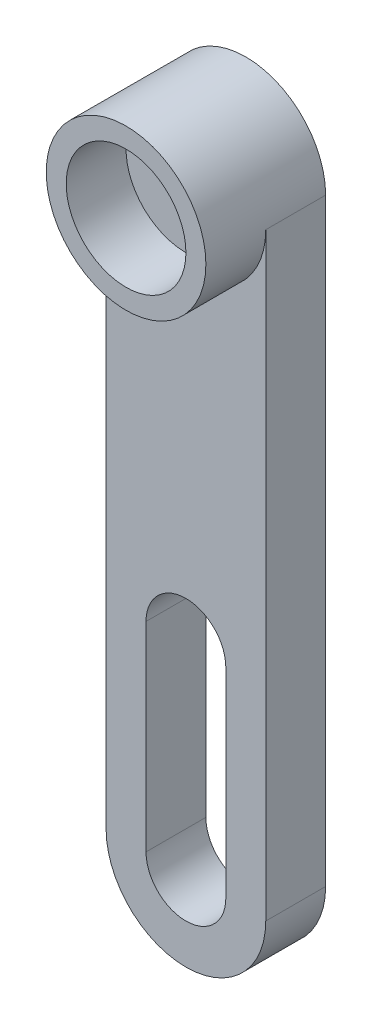
ISO-10303-21;
HEADER;
FILE_DESCRIPTION(('STEP AP214'),'2;1');
FILE_NAME('part.step','',(''),(''),'','','');
FILE_SCHEMA(('AUTOMOTIVE_DESIGN { 1 0 10303 214 1 1 1 1 }'));
ENDSEC;
DATA;
#1=APPLICATION_CONTEXT('core data for automotive mechanical design processes');
#2=APPLICATION_PROTOCOL_DEFINITION('international standard','automotive_design',2000,#1);
#3=PRODUCT_CONTEXT('',#1,'mechanical');
#4=PRODUCT('Part','Part','',(#3));
#5=PRODUCT_RELATED_PRODUCT_CATEGORY('part','',(#4));
#6=PRODUCT_DEFINITION_FORMATION('','',#4);
#7=PRODUCT_DEFINITION_CONTEXT('part definition',#1,'design');
#8=PRODUCT_DEFINITION('design','',#6,#7);
#9=PRODUCT_DEFINITION_SHAPE('','',#8);
#10=(LENGTH_UNIT() NAMED_UNIT(*) SI_UNIT(.MILLI.,.METRE.));
#11=(NAMED_UNIT(*) PLANE_ANGLE_UNIT() SI_UNIT($,.RADIAN.));
#12=(NAMED_UNIT(*) SI_UNIT($,.STERADIAN.) SOLID_ANGLE_UNIT());
#13=UNCERTAINTY_MEASURE_WITH_UNIT(LENGTH_MEASURE(1.E-05),#10,'distance_accuracy_value','');
#14=(GEOMETRIC_REPRESENTATION_CONTEXT(3) GLOBAL_UNCERTAINTY_ASSIGNED_CONTEXT((#13)) GLOBAL_UNIT_ASSIGNED_CONTEXT((#10,
#11,#12)) REPRESENTATION_CONTEXT('',''));
#15=CARTESIAN_POINT('',(0.,0.,0.));
#16=DIRECTION('',(0.,0.,1.));
#17=DIRECTION('',(1.,0.,0.));
#18=AXIS2_PLACEMENT_3D('',#15,#16,#17);
#19=CARTESIAN_POINT('',(0.,15.,3.));
#20=DIRECTION('',(0.,0.,1.));
#21=DIRECTION('',(1.,0.,0.));
#22=AXIS2_PLACEMENT_3D('',#19,#20,#21);
#23=PLANE('',#22);
#24=CARTESIAN_POINT('',(0.,15.,3.));
#25=DIRECTION('',(0.,0.,1.));
#26=DIRECTION('',(1.,0.,0.));
#27=AXIS2_PLACEMENT_3D('',#24,#25,#26);
#28=CIRCLE('',#27,1.25);
#29=CARTESIAN_POINT('',(1.25,15.,3.));
#30=VERTEX_POINT('',#29);
#31=EDGE_CURVE('E159',#30,#30,#28,.T.);
#32=ORIENTED_EDGE('',*,*,#31,.F.);
#33=EDGE_LOOP('',(#32));
#34=FACE_BOUND('',#33,.T.);
#35=CARTESIAN_POINT('',(0.,15.,3.));
#36=DIRECTION('',(0.,0.,1.));
#37=DIRECTION('',(1.,0.,0.));
#38=AXIS2_PLACEMENT_3D('',#35,#36,#37);
#39=CIRCLE('',#38,3.);
#40=CARTESIAN_POINT('',(3.,15.,3.));
#41=VERTEX_POINT('',#40);
#42=EDGE_CURVE('E214',#41,#41,#39,.T.);
#43=ORIENTED_EDGE('',*,*,#42,.T.);
#44=EDGE_LOOP('',(#43));
#45=FACE_BOUND('',#44,.T.);
#46=ADVANCED_FACE('F43',(#34,#45),#23,.T.);
#47=CARTESIAN_POINT('',(0.,15.,3.));
#48=DIRECTION('',(0.,0.,1.));
#49=DIRECTION('',(1.,0.,0.));
#50=AXIS2_PLACEMENT_3D('',#47,#48,#49);
#51=CIRCLE('',#50,4.);
#52=CARTESIAN_POINT('',(-4.00000000000001,15.,3.));
#53=VERTEX_POINT('',#52);
#54=CARTESIAN_POINT('',(3.99999999999999,15.,3.));
#55=VERTEX_POINT('',#54);
#56=EDGE_CURVE('E11',#53,#55,#51,.T.);
#57=ORIENTED_EDGE('',*,*,#56,.F.);
#58=DIRECTION('',(0.,-1.,0.));
#59=VECTOR('',#58,1.);
#60=CARTESIAN_POINT('',(-4.00000000000001,15.,3.));
#61=LINE('',#60,#59);
#62=CARTESIAN_POINT('',(-4.,-15.,3.));
#63=VERTEX_POINT('',#62);
#64=EDGE_CURVE('E151',#53,#63,#61,.T.);
#65=ORIENTED_EDGE('',*,*,#64,.T.);
#66=CARTESIAN_POINT('',(0.,-15.,3.));
#67=DIRECTION('',(0.,0.,1.));
#68=DIRECTION('',(1.,0.,0.));
#69=AXIS2_PLACEMENT_3D('',#66,#67,#68);
#70=CIRCLE('',#69,4.);
#71=CARTESIAN_POINT('',(4.00000000000001,-15.,3.));
#72=VERTEX_POINT('',#71);
#73=EDGE_CURVE('E130',#63,#72,#70,.T.);
#74=ORIENTED_EDGE('',*,*,#73,.T.);
#75=DIRECTION('',(0.,1.,0.));
#76=VECTOR('',#75,1.);
#77=CARTESIAN_POINT('',(4.,15.,3.));
#78=LINE('',#77,#76);
#79=EDGE_CURVE('E116',#72,#55,#78,.T.);
#80=ORIENTED_EDGE('',*,*,#79,.T.);
#81=EDGE_LOOP('',(#57,#65,#74,#80));
#82=FACE_BOUND('',#81,.T.);
#83=DIRECTION('',(0.,-1.,0.));
#84=VECTOR('',#83,1.);
#85=CARTESIAN_POINT('',(-2.,-5.,3.));
#86=LINE('',#85,#84);
#87=CARTESIAN_POINT('',(-2.,-5.,3.));
#88=VERTEX_POINT('',#87);
#89=CARTESIAN_POINT('',(-2.,-15.,3.));
#90=VERTEX_POINT('',#89);
#91=EDGE_CURVE('E205',#88,#90,#86,.T.);
#92=ORIENTED_EDGE('',*,*,#91,.F.);
#93=CARTESIAN_POINT('',(0.,-5.,3.));
#94=DIRECTION('',(0.,0.,1.));
#95=DIRECTION('',(1.,0.,0.));
#96=AXIS2_PLACEMENT_3D('',#93,#94,#95);
#97=CIRCLE('',#96,2.);
#98=CARTESIAN_POINT('',(2.,-5.,3.));
#99=VERTEX_POINT('',#98);
#100=EDGE_CURVE('E188',#99,#88,#97,.T.);
#101=ORIENTED_EDGE('',*,*,#100,.F.);
#102=DIRECTION('',(0.,1.,0.));
#103=VECTOR('',#102,1.);
#104=CARTESIAN_POINT('',(2.,-15.,3.));
#105=LINE('',#104,#103);
#106=CARTESIAN_POINT('',(2.,-15.,3.));
#107=VERTEX_POINT('',#106);
#108=EDGE_CURVE('E183',#107,#99,#105,.T.);
#109=ORIENTED_EDGE('',*,*,#108,.F.);
#110=CARTESIAN_POINT('',(0.,-15.,3.));
#111=DIRECTION('',(0.,0.,1.));
#112=DIRECTION('',(1.,0.,0.));
#113=AXIS2_PLACEMENT_3D('',#110,#111,#112);
#114=CIRCLE('',#113,2.);
#115=EDGE_CURVE('E202',#90,#107,#114,.T.);
#116=ORIENTED_EDGE('',*,*,#115,.F.);
#117=EDGE_LOOP('',(#92,#101,#109,#116));
#118=FACE_BOUND('',#117,.T.);
#119=ADVANCED_FACE('F126',(#82,#118),#23,.T.);
#120=CARTESIAN_POINT('',(0.,15.,0.));
#121=DIRECTION('',(0.,0.,1.));
#122=DIRECTION('',(1.,0.,0.));
#123=AXIS2_PLACEMENT_3D('',#120,#121,#122);
#124=PLANE('',#123);
#125=CARTESIAN_POINT('',(0.,15.,0.));
#126=DIRECTION('',(0.,0.,1.));
#127=DIRECTION('',(1.,0.,0.));
#128=AXIS2_PLACEMENT_3D('',#125,#126,#127);
#129=CIRCLE('',#128,1.25);
#130=CARTESIAN_POINT('',(1.25,15.,0.));
#131=VERTEX_POINT('',#130);
#132=EDGE_CURVE('E165',#131,#131,#129,.T.);
#133=ORIENTED_EDGE('',*,*,#132,.T.);
#134=EDGE_LOOP('',(#133));
#135=FACE_BOUND('',#134,.T.);
#136=CARTESIAN_POINT('',(0.,15.,0.));
#137=DIRECTION('',(0.,0.,1.));
#138=DIRECTION('',(1.,0.,0.));
#139=AXIS2_PLACEMENT_3D('',#136,#137,#138);
#140=CIRCLE('',#139,4.);
#141=CARTESIAN_POINT('',(4.,15.,0.));
#142=VERTEX_POINT('',#141);
#143=CARTESIAN_POINT('',(-4.00000000000001,15.,0.));
#144=VERTEX_POINT('',#143);
#145=EDGE_CURVE('E137',#142,#144,#140,.T.);
#146=ORIENTED_EDGE('',*,*,#145,.F.);
#147=DIRECTION('',(0.,1.,0.));
#148=VECTOR('',#147,1.);
#149=CARTESIAN_POINT('',(4.,15.,0.));
#150=LINE('',#149,#148);
#151=CARTESIAN_POINT('',(4.00000000000001,-15.,0.));
#152=VERTEX_POINT('',#151);
#153=EDGE_CURVE('E118',#152,#142,#150,.T.);
#154=ORIENTED_EDGE('',*,*,#153,.F.);
#155=CARTESIAN_POINT('',(0.,-15.,0.));
#156=DIRECTION('',(0.,0.,1.));
#157=DIRECTION('',(1.,0.,0.));
#158=AXIS2_PLACEMENT_3D('',#155,#156,#157);
#159=CIRCLE('',#158,4.);
#160=CARTESIAN_POINT('',(-4.,-15.,0.));
#161=VERTEX_POINT('',#160);
#162=EDGE_CURVE('E152',#161,#152,#159,.T.);
#163=ORIENTED_EDGE('',*,*,#162,.F.);
#164=DIRECTION('',(0.,-1.,0.));
#165=VECTOR('',#164,1.);
#166=CARTESIAN_POINT('',(-4.00000000000001,15.,0.));
#167=LINE('',#166,#165);
#168=EDGE_CURVE('E155',#144,#161,#167,.T.);
#169=ORIENTED_EDGE('',*,*,#168,.F.);
#170=EDGE_LOOP('',(#146,#154,#163,#169));
#171=FACE_BOUND('',#170,.T.);
#172=CARTESIAN_POINT('',(0.,-5.,0.));
#173=DIRECTION('',(0.,0.,1.));
#174=DIRECTION('',(1.,0.,0.));
#175=AXIS2_PLACEMENT_3D('',#172,#173,#174);
#176=CIRCLE('',#175,2.);
#177=CARTESIAN_POINT('',(2.,-5.,0.));
#178=VERTEX_POINT('',#177);
#179=CARTESIAN_POINT('',(-2.,-5.,0.));
#180=VERTEX_POINT('',#179);
#181=EDGE_CURVE('E68',#178,#180,#176,.T.);
#182=ORIENTED_EDGE('',*,*,#181,.T.);
#183=DIRECTION('',(0.,-1.,0.));
#184=VECTOR('',#183,1.);
#185=CARTESIAN_POINT('',(-2.,-5.,0.));
#186=LINE('',#185,#184);
#187=CARTESIAN_POINT('',(-2.,-15.,0.));
#188=VERTEX_POINT('',#187);
#189=EDGE_CURVE('E193',#180,#188,#186,.T.);
#190=ORIENTED_EDGE('',*,*,#189,.T.);
#191=CARTESIAN_POINT('',(0.,-15.,0.));
#192=DIRECTION('',(0.,0.,1.));
#193=DIRECTION('',(1.,0.,0.));
#194=AXIS2_PLACEMENT_3D('',#191,#192,#193);
#195=CIRCLE('',#194,2.);
#196=CARTESIAN_POINT('',(2.,-15.,0.));
#197=VERTEX_POINT('',#196);
#198=EDGE_CURVE('E189',#188,#197,#195,.T.);
#199=ORIENTED_EDGE('',*,*,#198,.T.);
#200=DIRECTION('',(0.,1.,0.));
#201=VECTOR('',#200,1.);
#202=CARTESIAN_POINT('',(2.,-15.,0.));
#203=LINE('',#202,#201);
#204=EDGE_CURVE('E184',#197,#178,#203,.T.);
#205=ORIENTED_EDGE('',*,*,#204,.T.);
#206=EDGE_LOOP('',(#182,#190,#199,#205));
#207=FACE_BOUND('',#206,.T.);
#208=ADVANCED_FACE('F243',(#135,#171,#207),#124,.F.);
#209=CARTESIAN_POINT('',(0.,15.,3.));
#210=DIRECTION('',(0.,0.,-1.));
#211=DIRECTION('',(-1.,0.,0.));
#212=AXIS2_PLACEMENT_3D('',#209,#210,#211);
#213=CYLINDRICAL_SURFACE('',#212,4.);
#214=ORIENTED_EDGE('',*,*,#145,.T.);
#215=DIRECTION('',(0.,0.,-1.));
#216=VECTOR('',#215,1.);
#217=CARTESIAN_POINT('',(-4.00000000000001,15.,3.));
#218=LINE('',#217,#216);
#219=EDGE_CURVE('E47',#53,#144,#218,.T.);
#220=ORIENTED_EDGE('',*,*,#219,.F.);
#221=ORIENTED_EDGE('',*,*,#56,.T.);
#222=DIRECTION('',(0.,0.,-1.));
#223=VECTOR('',#222,1.);
#224=CARTESIAN_POINT('',(4.,15.,3.));
#225=LINE('',#224,#223);
#226=EDGE_CURVE('E112',#55,#142,#225,.T.);
#227=ORIENTED_EDGE('',*,*,#226,.T.);
#228=EDGE_LOOP('',(#214,#220,#221,#227));
#229=FACE_BOUND('',#228,.T.);
#230=CARTESIAN_POINT('',(0.,15.,6.));
#231=DIRECTION('',(0.,0.,1.));
#232=DIRECTION('',(1.,0.,0.));
#233=AXIS2_PLACEMENT_3D('',#230,#231,#232);
#234=CIRCLE('',#233,4.);
#235=CARTESIAN_POINT('',(3.99999999999999,15.,6.));
#236=VERTEX_POINT('',#235);
#237=EDGE_CURVE('E199',#236,#236,#234,.T.);
#238=ORIENTED_EDGE('',*,*,#237,.F.);
#239=EDGE_LOOP('',(#238));
#240=FACE_BOUND('',#239,.T.);
#241=ADVANCED_FACE('F45',(#229,#240),#213,.T.);
#242=CARTESIAN_POINT('',(-4.00000000000001,15.,3.));
#243=DIRECTION('',(1.,0.,0.));
#244=DIRECTION('',(0.,1.,0.));
#245=AXIS2_PLACEMENT_3D('',#242,#243,#244);
#246=PLANE('',#245);
#247=ORIENTED_EDGE('',*,*,#168,.T.);
#248=DIRECTION('',(0.,0.,-1.));
#249=VECTOR('',#248,1.);
#250=CARTESIAN_POINT('',(-4.,-15.,3.));
#251=LINE('',#250,#249);
#252=EDGE_CURVE('E140',#63,#161,#251,.T.);
#253=ORIENTED_EDGE('',*,*,#252,.F.);
#254=ORIENTED_EDGE('',*,*,#64,.F.);
#255=ORIENTED_EDGE('',*,*,#219,.T.);
#256=EDGE_LOOP('',(#247,#253,#254,#255));
#257=FACE_BOUND('',#256,.T.);
#258=ADVANCED_FACE('F257',(#257),#246,.F.);
#259=CARTESIAN_POINT('',(0.,-15.,3.));
#260=DIRECTION('',(0.,0.,-1.));
#261=DIRECTION('',(-1.,0.,0.));
#262=AXIS2_PLACEMENT_3D('',#259,#260,#261);
#263=CYLINDRICAL_SURFACE('',#262,4.);
#264=ORIENTED_EDGE('',*,*,#162,.T.);
#265=DIRECTION('',(0.,0.,-1.));
#266=VECTOR('',#265,1.);
#267=CARTESIAN_POINT('',(4.00000000000001,-15.,3.));
#268=LINE('',#267,#266);
#269=EDGE_CURVE('E123',#72,#152,#268,.T.);
#270=ORIENTED_EDGE('',*,*,#269,.F.);
#271=ORIENTED_EDGE('',*,*,#73,.F.);
#272=ORIENTED_EDGE('',*,*,#252,.T.);
#273=EDGE_LOOP('',(#264,#270,#271,#272));
#274=FACE_BOUND('',#273,.T.);
#275=ADVANCED_FACE('F255',(#274),#263,.T.);
#276=CARTESIAN_POINT('',(4.,15.,3.));
#277=DIRECTION('',(-1.,0.,0.));
#278=DIRECTION('',(0.,-1.,0.));
#279=AXIS2_PLACEMENT_3D('',#276,#277,#278);
#280=PLANE('',#279);
#281=ORIENTED_EDGE('',*,*,#153,.T.);
#282=ORIENTED_EDGE('',*,*,#226,.F.);
#283=ORIENTED_EDGE('',*,*,#79,.F.);
#284=ORIENTED_EDGE('',*,*,#269,.T.);
#285=EDGE_LOOP('',(#281,#282,#283,#284));
#286=FACE_BOUND('',#285,.T.);
#287=ADVANCED_FACE('F114',(#286),#280,.F.);
#288=CARTESIAN_POINT('',(0.,15.,3.));
#289=DIRECTION('',(0.,0.,-1.));
#290=DIRECTION('',(-1.,0.,0.));
#291=AXIS2_PLACEMENT_3D('',#288,#289,#290);
#292=CYLINDRICAL_SURFACE('',#291,1.25);
#293=ORIENTED_EDGE('',*,*,#31,.T.);
#294=EDGE_LOOP('',(#293));
#295=FACE_BOUND('',#294,.T.);
#296=ORIENTED_EDGE('',*,*,#132,.F.);
#297=EDGE_LOOP('',(#296));
#298=FACE_BOUND('',#297,.T.);
#299=ADVANCED_FACE('F248',(#295,#298),#292,.F.);
#300=CARTESIAN_POINT('',(0.,-5.,3.));
#301=DIRECTION('',(0.,0.,-1.));
#302=DIRECTION('',(-1.,0.,0.));
#303=AXIS2_PLACEMENT_3D('',#300,#301,#302);
#304=CYLINDRICAL_SURFACE('',#303,2.);
#305=ORIENTED_EDGE('',*,*,#181,.F.);
#306=DIRECTION('',(0.,0.,-1.));
#307=VECTOR('',#306,1.);
#308=CARTESIAN_POINT('',(2.,-5.,3.));
#309=LINE('',#308,#307);
#310=EDGE_CURVE('E180',#99,#178,#309,.T.);
#311=ORIENTED_EDGE('',*,*,#310,.F.);
#312=ORIENTED_EDGE('',*,*,#100,.T.);
#313=DIRECTION('',(0.,0.,-1.));
#314=VECTOR('',#313,1.);
#315=CARTESIAN_POINT('',(-2.,-5.,3.));
#316=LINE('',#315,#314);
#317=EDGE_CURVE('E169',#88,#180,#316,.T.);
#318=ORIENTED_EDGE('',*,*,#317,.T.);
#319=EDGE_LOOP('',(#305,#311,#312,#318));
#320=FACE_BOUND('',#319,.T.);
#321=ADVANCED_FACE('F267',(#320),#304,.F.);
#322=CARTESIAN_POINT('',(-2.,-5.,3.));
#323=DIRECTION('',(1.,0.,0.));
#324=DIRECTION('',(0.,1.,0.));
#325=AXIS2_PLACEMENT_3D('',#322,#323,#324);
#326=PLANE('',#325);
#327=ORIENTED_EDGE('',*,*,#189,.F.);
#328=ORIENTED_EDGE('',*,*,#317,.F.);
#329=ORIENTED_EDGE('',*,*,#91,.T.);
#330=DIRECTION('',(0.,0.,-1.));
#331=VECTOR('',#330,1.);
#332=CARTESIAN_POINT('',(-2.,-15.,3.));
#333=LINE('',#332,#331);
#334=EDGE_CURVE('E175',#90,#188,#333,.T.);
#335=ORIENTED_EDGE('',*,*,#334,.T.);
#336=EDGE_LOOP('',(#327,#328,#329,#335));
#337=FACE_BOUND('',#336,.T.);
#338=ADVANCED_FACE('F273',(#337),#326,.T.);
#339=CARTESIAN_POINT('',(0.,-15.,3.));
#340=DIRECTION('',(0.,0.,-1.));
#341=DIRECTION('',(-1.,0.,0.));
#342=AXIS2_PLACEMENT_3D('',#339,#340,#341);
#343=CYLINDRICAL_SURFACE('',#342,2.);
#344=ORIENTED_EDGE('',*,*,#198,.F.);
#345=ORIENTED_EDGE('',*,*,#334,.F.);
#346=ORIENTED_EDGE('',*,*,#115,.T.);
#347=DIRECTION('',(0.,0.,-1.));
#348=VECTOR('',#347,1.);
#349=CARTESIAN_POINT('',(2.,-15.,3.));
#350=LINE('',#349,#348);
#351=EDGE_CURVE('E60',#107,#197,#350,.T.);
#352=ORIENTED_EDGE('',*,*,#351,.T.);
#353=EDGE_LOOP('',(#344,#345,#346,#352));
#354=FACE_BOUND('',#353,.T.);
#355=ADVANCED_FACE('F235',(#354),#343,.F.);
#356=CARTESIAN_POINT('',(2.,-15.,3.));
#357=DIRECTION('',(-1.,0.,0.));
#358=DIRECTION('',(0.,-1.,0.));
#359=AXIS2_PLACEMENT_3D('',#356,#357,#358);
#360=PLANE('',#359);
#361=ORIENTED_EDGE('',*,*,#204,.F.);
#362=ORIENTED_EDGE('',*,*,#351,.F.);
#363=ORIENTED_EDGE('',*,*,#108,.T.);
#364=ORIENTED_EDGE('',*,*,#310,.T.);
#365=EDGE_LOOP('',(#361,#362,#363,#364));
#366=FACE_BOUND('',#365,.T.);
#367=ADVANCED_FACE('F227',(#366),#360,.T.);
#368=CARTESIAN_POINT('',(0.,15.,6.));
#369=DIRECTION('',(0.,0.,1.));
#370=DIRECTION('',(1.,0.,0.));
#371=AXIS2_PLACEMENT_3D('',#368,#369,#370);
#372=PLANE('',#371);
#373=ORIENTED_EDGE('',*,*,#237,.T.);
#374=EDGE_LOOP('',(#373));
#375=FACE_BOUND('',#374,.T.);
#376=CARTESIAN_POINT('',(0.,15.,6.));
#377=DIRECTION('',(0.,0.,1.));
#378=DIRECTION('',(1.,0.,0.));
#379=AXIS2_PLACEMENT_3D('',#376,#377,#378);
#380=CIRCLE('',#379,3.);
#381=CARTESIAN_POINT('',(3.,15.,6.));
#382=VERTEX_POINT('',#381);
#383=EDGE_CURVE('E213',#382,#382,#380,.T.);
#384=ORIENTED_EDGE('',*,*,#383,.F.);
#385=EDGE_LOOP('',(#384));
#386=FACE_BOUND('',#385,.T.);
#387=ADVANCED_FACE('F225',(#375,#386),#372,.T.);
#388=CARTESIAN_POINT('',(0.,15.,6.));
#389=DIRECTION('',(0.,0.,-1.));
#390=DIRECTION('',(-1.,0.,0.));
#391=AXIS2_PLACEMENT_3D('',#388,#389,#390);
#392=CYLINDRICAL_SURFACE('',#391,3.);
#393=ORIENTED_EDGE('',*,*,#383,.T.);
#394=EDGE_LOOP('',(#393));
#395=FACE_BOUND('',#394,.T.);
#396=ORIENTED_EDGE('',*,*,#42,.F.);
#397=EDGE_LOOP('',(#396));
#398=FACE_BOUND('',#397,.T.);
#399=ADVANCED_FACE('F222',(#395,#398),#392,.F.);
#400=CLOSED_SHELL('',(#46,#119,#208,#241,#258,#275,#287,#299,#321,#338,#355,#367,#387,#399));
#401=MANIFOLD_SOLID_BREP('B2',#400);
#402=ADVANCED_BREP_SHAPE_REPRESENTATION('',(#18,#401),#14);
#403=SHAPE_DEFINITION_REPRESENTATION(#9,#402);
ENDSEC;
END-ISO-10303-21;
